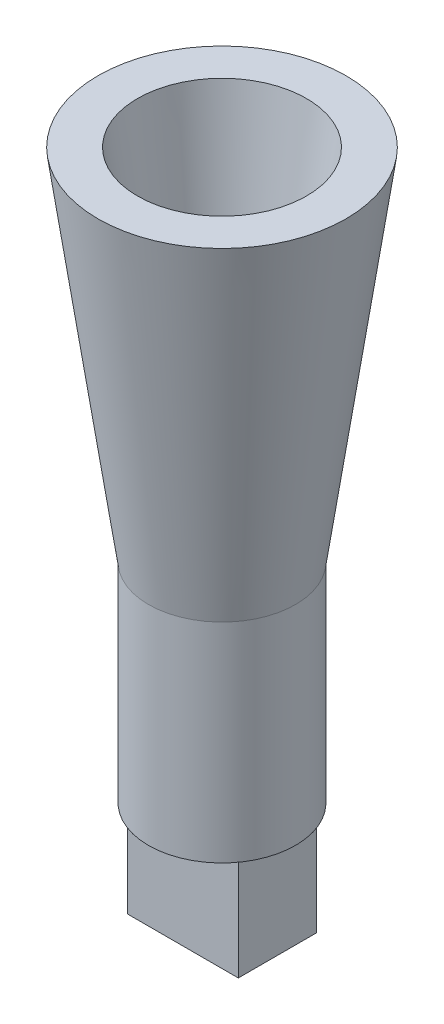
ISO-10303-21;
HEADER;
FILE_DESCRIPTION(('STEP AP214'),'2;1');
FILE_NAME('part.step','',(''),(''),'','','');
FILE_SCHEMA(('AUTOMOTIVE_DESIGN { 1 0 10303 214 1 1 1 1 }'));
ENDSEC;
DATA;
#1=APPLICATION_CONTEXT('core data for automotive mechanical design processes');
#2=APPLICATION_PROTOCOL_DEFINITION('international standard','automotive_design',2000,#1);
#3=PRODUCT_CONTEXT('',#1,'mechanical');
#4=PRODUCT('Part','Part','',(#3));
#5=PRODUCT_RELATED_PRODUCT_CATEGORY('part','',(#4));
#6=PRODUCT_DEFINITION_FORMATION('','',#4);
#7=PRODUCT_DEFINITION_CONTEXT('part definition',#1,'design');
#8=PRODUCT_DEFINITION('design','',#6,#7);
#9=PRODUCT_DEFINITION_SHAPE('','',#8);
#10=(LENGTH_UNIT() NAMED_UNIT(*) SI_UNIT(.MILLI.,.METRE.));
#11=(NAMED_UNIT(*) PLANE_ANGLE_UNIT() SI_UNIT($,.RADIAN.));
#12=(NAMED_UNIT(*) SI_UNIT($,.STERADIAN.) SOLID_ANGLE_UNIT());
#13=UNCERTAINTY_MEASURE_WITH_UNIT(LENGTH_MEASURE(1.E-05),#10,'distance_accuracy_value','');
#14=(GEOMETRIC_REPRESENTATION_CONTEXT(3) GLOBAL_UNCERTAINTY_ASSIGNED_CONTEXT((#13)) GLOBAL_UNIT_ASSIGNED_CONTEXT((#10,
#11,#12)) REPRESENTATION_CONTEXT('',''));
#15=CARTESIAN_POINT('',(0.,0.,0.));
#16=DIRECTION('',(0.,0.,1.));
#17=DIRECTION('',(1.,0.,0.));
#18=AXIS2_PLACEMENT_3D('',#15,#16,#17);
#19=CARTESIAN_POINT('',(54.,101.6,-38.1));
#20=DIRECTION('',(-1.,0.,0.));
#21=DIRECTION('',(0.,0.,1.));
#22=AXIS2_PLACEMENT_3D('',#19,#20,#21);
#23=PLANE('',#22);
#24=DIRECTION('',(0.,0.,-1.));
#25=VECTOR('',#24,1.);
#26=CARTESIAN_POINT('',(54.,0.,-38.1));
#27=LINE('',#26,#25);
#28=CARTESIAN_POINT('',(54.,0.,38.1));
#29=VERTEX_POINT('',#28);
#30=CARTESIAN_POINT('',(54.,0.,-38.1));
#31=VERTEX_POINT('',#30);
#32=EDGE_CURVE('E113',#29,#31,#27,.T.);
#33=ORIENTED_EDGE('',*,*,#32,.T.);
#34=DIRECTION('',(0.,-1.,0.));
#35=VECTOR('',#34,1.);
#36=CARTESIAN_POINT('',(54.,101.6,-38.1));
#37=LINE('',#36,#35);
#38=CARTESIAN_POINT('',(54.,101.6,-38.1));
#39=VERTEX_POINT('',#38);
#40=EDGE_CURVE('E11',#39,#31,#37,.T.);
#41=ORIENTED_EDGE('',*,*,#40,.F.);
#42=DIRECTION('',(0.,0.,-1.));
#43=VECTOR('',#42,1.);
#44=CARTESIAN_POINT('',(54.,101.6,-38.1));
#45=LINE('',#44,#43);
#46=CARTESIAN_POINT('',(54.,101.6,38.1));
#47=VERTEX_POINT('',#46);
#48=EDGE_CURVE('E92',#47,#39,#45,.T.);
#49=ORIENTED_EDGE('',*,*,#48,.F.);
#50=DIRECTION('',(0.,-1.,0.));
#51=VECTOR('',#50,1.);
#52=CARTESIAN_POINT('',(54.,101.6,38.1));
#53=LINE('',#52,#51);
#54=EDGE_CURVE('E94',#47,#29,#53,.T.);
#55=ORIENTED_EDGE('',*,*,#54,.T.);
#56=EDGE_LOOP('',(#33,#41,#49,#55));
#57=FACE_BOUND('',#56,.T.);
#58=ADVANCED_FACE('F43',(#57),#23,.F.);
#59=CARTESIAN_POINT('',(-54.,101.6,-38.1));
#60=DIRECTION('',(0.,0.,1.));
#61=DIRECTION('',(1.,0.,0.));
#62=AXIS2_PLACEMENT_3D('',#59,#60,#61);
#63=PLANE('',#62);
#64=DIRECTION('',(-1.,0.,0.));
#65=VECTOR('',#64,1.);
#66=CARTESIAN_POINT('',(-54.,0.,-38.1));
#67=LINE('',#66,#65);
#68=CARTESIAN_POINT('',(-54.,0.,-38.1));
#69=VERTEX_POINT('',#68);
#70=EDGE_CURVE('E116',#31,#69,#67,.T.);
#71=ORIENTED_EDGE('',*,*,#70,.T.);
#72=DIRECTION('',(0.,-1.,0.));
#73=VECTOR('',#72,1.);
#74=CARTESIAN_POINT('',(-54.,101.6,-38.1));
#75=LINE('',#74,#73);
#76=CARTESIAN_POINT('',(-54.,101.6,-38.1));
#77=VERTEX_POINT('',#76);
#78=EDGE_CURVE('E52',#77,#69,#75,.T.);
#79=ORIENTED_EDGE('',*,*,#78,.F.);
#80=DIRECTION('',(-1.,0.,0.));
#81=VECTOR('',#80,1.);
#82=CARTESIAN_POINT('',(-54.,101.6,-38.1));
#83=LINE('',#82,#81);
#84=EDGE_CURVE('E86',#39,#77,#83,.T.);
#85=ORIENTED_EDGE('',*,*,#84,.F.);
#86=ORIENTED_EDGE('',*,*,#40,.T.);
#87=EDGE_LOOP('',(#71,#79,#85,#86));
#88=FACE_BOUND('',#87,.T.);
#89=ADVANCED_FACE('F129',(#88),#63,.F.);
#90=CARTESIAN_POINT('',(-54.,101.6,-38.1));
#91=DIRECTION('',(1.,0.,0.));
#92=DIRECTION('',(0.,0.,-1.));
#93=AXIS2_PLACEMENT_3D('',#90,#91,#92);
#94=PLANE('',#93);
#95=DIRECTION('',(0.,0.,1.));
#96=VECTOR('',#95,1.);
#97=CARTESIAN_POINT('',(-54.,0.,-38.1));
#98=LINE('',#97,#96);
#99=CARTESIAN_POINT('',(-54.,0.,38.1));
#100=VERTEX_POINT('',#99);
#101=EDGE_CURVE('E76',#69,#100,#98,.T.);
#102=ORIENTED_EDGE('',*,*,#101,.T.);
#103=DIRECTION('',(0.,-1.,0.));
#104=VECTOR('',#103,1.);
#105=CARTESIAN_POINT('',(-54.,101.6,38.1));
#106=LINE('',#105,#104);
#107=CARTESIAN_POINT('',(-54.,101.6,38.1));
#108=VERTEX_POINT('',#107);
#109=EDGE_CURVE('E60',#108,#100,#106,.T.);
#110=ORIENTED_EDGE('',*,*,#109,.F.);
#111=DIRECTION('',(0.,0.,1.));
#112=VECTOR('',#111,1.);
#113=CARTESIAN_POINT('',(-54.,101.6,-38.1));
#114=LINE('',#113,#112);
#115=EDGE_CURVE('E106',#77,#108,#114,.T.);
#116=ORIENTED_EDGE('',*,*,#115,.F.);
#117=ORIENTED_EDGE('',*,*,#78,.T.);
#118=EDGE_LOOP('',(#102,#110,#116,#117));
#119=FACE_BOUND('',#118,.T.);
#120=ADVANCED_FACE('F126',(#119),#94,.F.);
#121=CARTESIAN_POINT('',(-54.,101.6,38.1));
#122=DIRECTION('',(0.,0.,-1.));
#123=DIRECTION('',(-1.,0.,0.));
#124=AXIS2_PLACEMENT_3D('',#121,#122,#123);
#125=PLANE('',#124);
#126=DIRECTION('',(1.,0.,0.));
#127=VECTOR('',#126,1.);
#128=CARTESIAN_POINT('',(-54.,0.,38.1));
#129=LINE('',#128,#127);
#130=EDGE_CURVE('E81',#100,#29,#129,.T.);
#131=ORIENTED_EDGE('',*,*,#130,.T.);
#132=ORIENTED_EDGE('',*,*,#54,.F.);
#133=DIRECTION('',(1.,0.,0.));
#134=VECTOR('',#133,1.);
#135=CARTESIAN_POINT('',(-54.,101.6,38.1));
#136=LINE('',#135,#134);
#137=EDGE_CURVE('E101',#108,#47,#136,.T.);
#138=ORIENTED_EDGE('',*,*,#137,.F.);
#139=ORIENTED_EDGE('',*,*,#109,.T.);
#140=EDGE_LOOP('',(#131,#132,#138,#139));
#141=FACE_BOUND('',#140,.T.);
#142=ADVANCED_FACE('F100',(#141),#125,.F.);
#143=CARTESIAN_POINT('',(0.,0.,0.));
#144=DIRECTION('',(0.,1.,0.));
#145=DIRECTION('',(0.,0.,1.));
#146=AXIS2_PLACEMENT_3D('',#143,#144,#145);
#147=PLANE('',#146);
#148=ORIENTED_EDGE('',*,*,#32,.F.);
#149=ORIENTED_EDGE('',*,*,#130,.F.);
#150=ORIENTED_EDGE('',*,*,#101,.F.);
#151=ORIENTED_EDGE('',*,*,#70,.F.);
#152=EDGE_LOOP('',(#148,#149,#150,#151));
#153=FACE_BOUND('',#152,.T.);
#154=ADVANCED_FACE('F128',(#153),#147,.F.);
#155=CARTESIAN_POINT('',(0.,101.6,0.));
#156=DIRECTION('',(0.,1.,0.));
#157=DIRECTION('',(0.,0.,1.));
#158=AXIS2_PLACEMENT_3D('',#155,#156,#157);
#159=PLANE('',#158);
#160=CARTESIAN_POINT('',(0.,101.6,0.));
#161=DIRECTION('',(0.,1.,0.));
#162=DIRECTION('',(0.,0.,1.));
#163=AXIS2_PLACEMENT_3D('',#160,#161,#162);
#164=CIRCLE('',#163,71.6160751058858);
#165=CARTESIAN_POINT('',(0.,101.6,71.6160751058858));
#166=VERTEX_POINT('',#165);
#167=EDGE_CURVE('E188',#166,#166,#164,.T.);
#168=ORIENTED_EDGE('',*,*,#167,.F.);
#169=EDGE_LOOP('',(#168));
#170=FACE_BOUND('',#169,.T.);
#171=ORIENTED_EDGE('',*,*,#137,.T.);
#172=ORIENTED_EDGE('',*,*,#48,.T.);
#173=ORIENTED_EDGE('',*,*,#84,.T.);
#174=ORIENTED_EDGE('',*,*,#115,.T.);
#175=EDGE_LOOP('',(#171,#172,#173,#174));
#176=FACE_BOUND('',#175,.T.);
#177=ADVANCED_FACE('F105',(#170,#176),#159,.F.);
#178=CARTESIAN_POINT('',(0.,304.8,0.));
#179=DIRECTION('',(0.,-1.,0.));
#180=DIRECTION('',(0.,0.,-1.));
#181=AXIS2_PLACEMENT_3D('',#178,#179,#180);
#182=CYLINDRICAL_SURFACE('',#181,71.6160751058858);
#183=CARTESIAN_POINT('',(0.,304.8,0.));
#184=DIRECTION('',(0.,1.,0.));
#185=DIRECTION('',(0.,0.,1.));
#186=AXIS2_PLACEMENT_3D('',#183,#184,#185);
#187=CIRCLE('',#186,71.6160751058858);
#188=CARTESIAN_POINT('',(0.,304.8,71.6160751058858));
#189=VERTEX_POINT('',#188);
#190=EDGE_CURVE('E117',#189,#189,#187,.T.);
#191=ORIENTED_EDGE('',*,*,#190,.F.);
#192=EDGE_LOOP('',(#191));
#193=FACE_BOUND('',#192,.T.);
#194=ORIENTED_EDGE('',*,*,#167,.T.);
#195=EDGE_LOOP('',(#194));
#196=FACE_BOUND('',#195,.T.);
#197=ADVANCED_FACE('F141',(#193,#196),#182,.T.);
#198=CARTESIAN_POINT('',(0.,304.8,0.));
#199=DIRECTION('',(0.,1.,0.));
#200=DIRECTION('',(0.,0.,1.));
#201=AXIS2_PLACEMENT_3D('',#198,#199,#200);
#202=CONICAL_SURFACE('',#201,71.6160751058858,0.139626340159547);
#203=CARTESIAN_POINT('',(0.,654.8,0.));
#204=DIRECTION('',(0.,1.,0.));
#205=DIRECTION('',(0.,0.,1.));
#206=AXIS2_PLACEMENT_3D('',#203,#204,#205);
#207=CIRCLE('',#206,120.805367251723);
#208=CARTESIAN_POINT('',(0.,654.8,120.805367251723));
#209=VERTEX_POINT('',#208);
#210=EDGE_CURVE('E180',#209,#209,#207,.T.);
#211=ORIENTED_EDGE('',*,*,#210,.F.);
#212=EDGE_LOOP('',(#211));
#213=FACE_BOUND('',#212,.T.);
#214=ORIENTED_EDGE('',*,*,#190,.T.);
#215=EDGE_LOOP('',(#214));
#216=FACE_BOUND('',#215,.T.);
#217=ADVANCED_FACE('F144',(#213,#216),#202,.T.);
#218=CARTESIAN_POINT('',(0.,654.8,0.));
#219=DIRECTION('',(0.,1.,0.));
#220=DIRECTION('',(0.,0.,1.));
#221=AXIS2_PLACEMENT_3D('',#218,#219,#220);
#222=PLANE('',#221);
#223=CARTESIAN_POINT('',(0.,654.8,0.));
#224=DIRECTION('',(0.,1.,0.));
#225=DIRECTION('',(0.,0.,1.));
#226=AXIS2_PLACEMENT_3D('',#223,#224,#225);
#227=CIRCLE('',#226,82.3309367387635);
#228=CARTESIAN_POINT('',(0.,654.8,82.3309367387635));
#229=VERTEX_POINT('',#228);
#230=EDGE_CURVE('E175',#229,#229,#227,.T.);
#231=ORIENTED_EDGE('',*,*,#230,.F.);
#232=EDGE_LOOP('',(#231));
#233=FACE_BOUND('',#232,.T.);
#234=ORIENTED_EDGE('',*,*,#210,.T.);
#235=EDGE_LOOP('',(#234));
#236=FACE_BOUND('',#235,.T.);
#237=ADVANCED_FACE('F151',(#233,#236),#222,.T.);
#238=CARTESIAN_POINT('',(0.,139.7,0.));
#239=DIRECTION('',(0.,1.,0.));
#240=DIRECTION('',(0.,0.,1.));
#241=AXIS2_PLACEMENT_3D('',#238,#239,#240);
#242=PLANE('',#241);
#243=CARTESIAN_POINT('',(0.,139.7,0.));
#244=DIRECTION('',(0.,1.,0.));
#245=DIRECTION('',(0.,0.,1.));
#246=AXIS2_PLACEMENT_3D('',#243,#244,#245);
#247=CIRCLE('',#246,33.5160751058858);
#248=CARTESIAN_POINT('',(0.,139.7,33.5160751058858));
#249=VERTEX_POINT('',#248);
#250=EDGE_CURVE('E171',#249,#249,#247,.T.);
#251=ORIENTED_EDGE('',*,*,#250,.T.);
#252=EDGE_LOOP('',(#251));
#253=FACE_BOUND('',#252,.T.);
#254=ADVANCED_FACE('F155',(#253),#242,.T.);
#255=CARTESIAN_POINT('',(0.,304.8,0.));
#256=DIRECTION('',(0.,-1.,0.));
#257=DIRECTION('',(0.,0.,-1.));
#258=AXIS2_PLACEMENT_3D('',#255,#256,#257);
#259=CYLINDRICAL_SURFACE('',#258,33.5160751058858);
#260=CARTESIAN_POINT('',(0.,307.464211535048,0.));
#261=DIRECTION('',(0.,1.,0.));
#262=DIRECTION('',(0.,0.,1.));
#263=AXIS2_PLACEMENT_3D('',#260,#261,#262);
#264=CIRCLE('',#263,33.5160751058858);
#265=CARTESIAN_POINT('',(0.,307.464211535048,33.5160751058858));
#266=VERTEX_POINT('',#265);
#267=EDGE_CURVE('E174',#266,#266,#264,.T.);
#268=ORIENTED_EDGE('',*,*,#267,.T.);
#269=EDGE_LOOP('',(#268));
#270=FACE_BOUND('',#269,.T.);
#271=ORIENTED_EDGE('',*,*,#250,.F.);
#272=EDGE_LOOP('',(#271));
#273=FACE_BOUND('',#272,.T.);
#274=ADVANCED_FACE('F160',(#270,#273),#259,.F.);
#275=CARTESIAN_POINT('',(0.,310.102495146578,0.));
#276=DIRECTION('',(0.,1.,0.));
#277=DIRECTION('',(0.,0.,1.));
#278=AXIS2_PLACEMENT_3D('',#275,#276,#277);
#279=CONICAL_SURFACE('',#278,33.8868616868319,0.139626340159547);
#280=ORIENTED_EDGE('',*,*,#230,.T.);
#281=EDGE_LOOP('',(#280));
#282=FACE_BOUND('',#281,.T.);
#283=ORIENTED_EDGE('',*,*,#267,.F.);
#284=EDGE_LOOP('',(#283));
#285=FACE_BOUND('',#284,.T.);
#286=ADVANCED_FACE('F157',(#282,#285),#279,.F.);
#287=CLOSED_SHELL('',(#58,#89,#120,#142,#154,#177,#197,#217,#237,#254,#274,#286));
#288=MANIFOLD_SOLID_BREP('B2',#287);
#289=ADVANCED_BREP_SHAPE_REPRESENTATION('',(#18,#288),#14);
#290=SHAPE_DEFINITION_REPRESENTATION(#9,#289);
ENDSEC;
END-ISO-10303-21;
